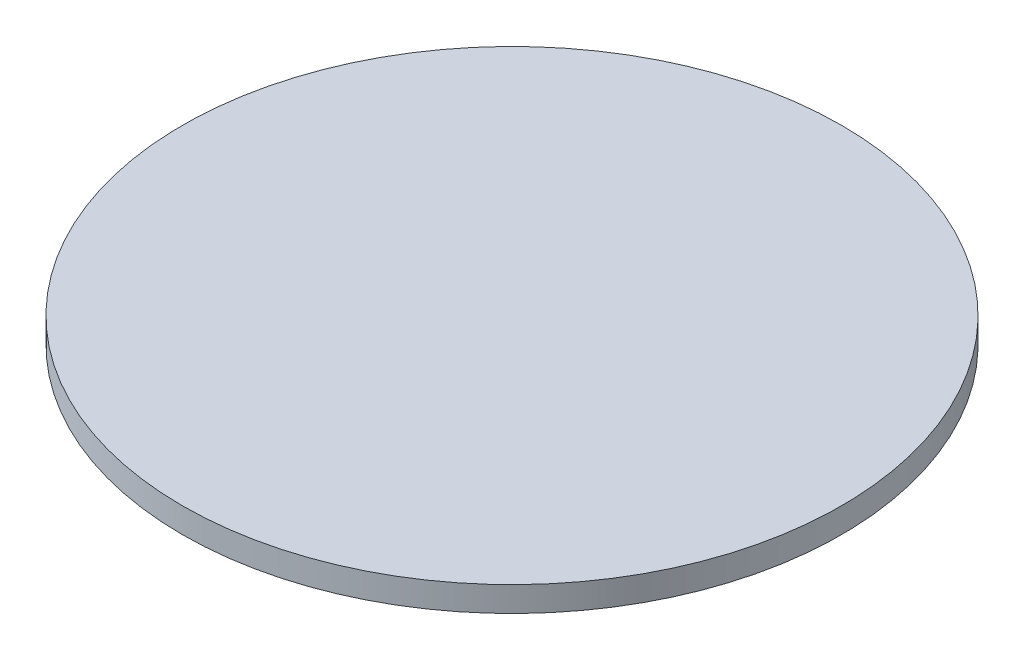
ISO-10303-21;
HEADER;
FILE_DESCRIPTION(('STEP AP214'),'2;1');
FILE_NAME('part.step','',(''),(''),'','','');
FILE_SCHEMA(('AUTOMOTIVE_DESIGN { 1 0 10303 214 1 1 1 1 }'));
ENDSEC;
DATA;
#1=APPLICATION_CONTEXT('core data for automotive mechanical design processes');
#2=APPLICATION_PROTOCOL_DEFINITION('international standard','automotive_design',2000,#1);
#3=PRODUCT_CONTEXT('',#1,'mechanical');
#4=PRODUCT('Part','Part','',(#3));
#5=PRODUCT_RELATED_PRODUCT_CATEGORY('part','',(#4));
#6=PRODUCT_DEFINITION_FORMATION('','',#4);
#7=PRODUCT_DEFINITION_CONTEXT('part definition',#1,'design');
#8=PRODUCT_DEFINITION('design','',#6,#7);
#9=PRODUCT_DEFINITION_SHAPE('','',#8);
#10=(LENGTH_UNIT() NAMED_UNIT(*) SI_UNIT(.MILLI.,.METRE.));
#11=(NAMED_UNIT(*) PLANE_ANGLE_UNIT() SI_UNIT($,.RADIAN.));
#12=(NAMED_UNIT(*) SI_UNIT($,.STERADIAN.) SOLID_ANGLE_UNIT());
#13=UNCERTAINTY_MEASURE_WITH_UNIT(LENGTH_MEASURE(1.E-05),#10,'distance_accuracy_value','');
#14=(GEOMETRIC_REPRESENTATION_CONTEXT(3) GLOBAL_UNCERTAINTY_ASSIGNED_CONTEXT((#13)) GLOBAL_UNIT_ASSIGNED_CONTEXT((#10,
#11,#12)) REPRESENTATION_CONTEXT('',''));
#15=CARTESIAN_POINT('',(0.,0.,0.));
#16=DIRECTION('',(0.,0.,1.));
#17=DIRECTION('',(1.,0.,0.));
#18=AXIS2_PLACEMENT_3D('',#15,#16,#17);
#19=CARTESIAN_POINT('',(0.,1.8,0.));
#20=DIRECTION('',(0.,-1.,0.));
#21=DIRECTION('',(0.,0.,-1.));
#22=AXIS2_PLACEMENT_3D('',#19,#20,#21);
#23=CYLINDRICAL_SURFACE('',#22,23.7);
#24=CARTESIAN_POINT('',(0.,1.8,0.));
#25=DIRECTION('',(0.,1.,0.));
#26=DIRECTION('',(0.,0.,1.));
#27=AXIS2_PLACEMENT_3D('',#24,#25,#26);
#28=CIRCLE('',#27,23.7);
#29=CARTESIAN_POINT('',(0.,1.8,23.7));
#30=VERTEX_POINT('',#29);
#31=EDGE_CURVE('E10',#30,#30,#28,.T.);
#32=ORIENTED_EDGE('',*,*,#31,.F.);
#33=EDGE_LOOP('',(#32));
#34=FACE_BOUND('',#33,.T.);
#35=CARTESIAN_POINT('',(0.,0.,0.));
#36=DIRECTION('',(0.,1.,0.));
#37=DIRECTION('',(0.,0.,1.));
#38=AXIS2_PLACEMENT_3D('',#35,#36,#37);
#39=CIRCLE('',#38,23.7);
#40=CARTESIAN_POINT('',(0.,0.,23.7));
#41=VERTEX_POINT('',#40);
#42=EDGE_CURVE('E38',#41,#41,#39,.T.);
#43=ORIENTED_EDGE('',*,*,#42,.T.);
#44=EDGE_LOOP('',(#43));
#45=FACE_BOUND('',#44,.T.);
#46=ADVANCED_FACE('F35',(#34,#45),#23,.T.);
#47=CARTESIAN_POINT('',(0.,1.8,0.));
#48=DIRECTION('',(0.,1.,0.));
#49=DIRECTION('',(0.,0.,1.));
#50=AXIS2_PLACEMENT_3D('',#47,#48,#49);
#51=PLANE('',#50);
#52=ORIENTED_EDGE('',*,*,#31,.T.);
#53=EDGE_LOOP('',(#52));
#54=FACE_BOUND('',#53,.T.);
#55=ADVANCED_FACE('F50',(#54),#51,.T.);
#56=CARTESIAN_POINT('',(0.,0.,0.));
#57=DIRECTION('',(0.,1.,0.));
#58=DIRECTION('',(0.,0.,1.));
#59=AXIS2_PLACEMENT_3D('',#56,#57,#58);
#60=PLANE('',#59);
#61=ORIENTED_EDGE('',*,*,#42,.F.);
#62=EDGE_LOOP('',(#61));
#63=FACE_BOUND('',#62,.T.);
#64=ADVANCED_FACE('F48',(#63),#60,.F.);
#65=CLOSED_SHELL('',(#46,#55,#64));
#66=MANIFOLD_SOLID_BREP('B2',#65);
#67=ADVANCED_BREP_SHAPE_REPRESENTATION('',(#18,#66),#14);
#68=SHAPE_DEFINITION_REPRESENTATION(#9,#67);
ENDSEC;
END-ISO-10303-21;
